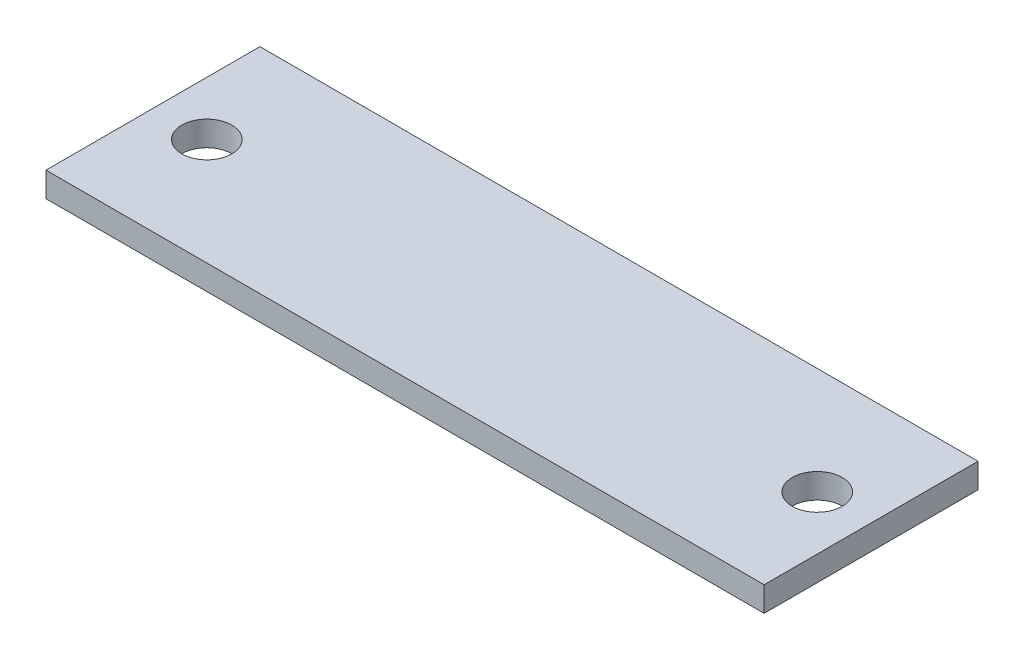
ISO-10303-21;
HEADER;
FILE_DESCRIPTION(('STEP AP214'),'2;1');
FILE_NAME('part.step','',(''),(''),'','','');
FILE_SCHEMA(('AUTOMOTIVE_DESIGN { 1 0 10303 214 1 1 1 1 }'));
ENDSEC;
DATA;
#1=APPLICATION_CONTEXT('core data for automotive mechanical design processes');
#2=APPLICATION_PROTOCOL_DEFINITION('international standard','automotive_design',2000,#1);
#3=PRODUCT_CONTEXT('',#1,'mechanical');
#4=PRODUCT('Part','Part','',(#3));
#5=PRODUCT_RELATED_PRODUCT_CATEGORY('part','',(#4));
#6=PRODUCT_DEFINITION_FORMATION('','',#4);
#7=PRODUCT_DEFINITION_CONTEXT('part definition',#1,'design');
#8=PRODUCT_DEFINITION('design','',#6,#7);
#9=PRODUCT_DEFINITION_SHAPE('','',#8);
#10=(LENGTH_UNIT() NAMED_UNIT(*) SI_UNIT(.MILLI.,.METRE.));
#11=(NAMED_UNIT(*) PLANE_ANGLE_UNIT() SI_UNIT($,.RADIAN.));
#12=(NAMED_UNIT(*) SI_UNIT($,.STERADIAN.) SOLID_ANGLE_UNIT());
#13=UNCERTAINTY_MEASURE_WITH_UNIT(LENGTH_MEASURE(1.E-05),#10,'distance_accuracy_value','');
#14=(GEOMETRIC_REPRESENTATION_CONTEXT(3) GLOBAL_UNCERTAINTY_ASSIGNED_CONTEXT((#13)) GLOBAL_UNIT_ASSIGNED_CONTEXT((#10,
#11,#12)) REPRESENTATION_CONTEXT('',''));
#15=CARTESIAN_POINT('',(0.,0.,0.));
#16=DIRECTION('',(0.,0.,1.));
#17=DIRECTION('',(1.,0.,0.));
#18=AXIS2_PLACEMENT_3D('',#15,#16,#17);
#19=CARTESIAN_POINT('',(0.,0.79375,0.));
#20=DIRECTION('',(0.,-1.,0.));
#21=DIRECTION('',(0.,0.,-1.));
#22=AXIS2_PLACEMENT_3D('',#19,#20,#21);
#23=PLANE('',#22);
#24=DIRECTION('',(0.,0.,-1.));
#25=VECTOR('',#24,1.);
#26=CARTESIAN_POINT('',(22.999999974,0.79375,6.850000016));
#27=LINE('',#26,#25);
#28=CARTESIAN_POINT('',(22.999999974,0.79375,6.850000016));
#29=VERTEX_POINT('',#28);
#30=CARTESIAN_POINT('',(22.999999974,0.79375,-6.850000016));
#31=VERTEX_POINT('',#30);
#32=EDGE_CURVE('E91',#29,#31,#27,.T.);
#33=ORIENTED_EDGE('',*,*,#32,.T.);
#34=DIRECTION('',(-1.,0.,0.));
#35=VECTOR('',#34,1.);
#36=CARTESIAN_POINT('',(-22.999999974,0.79375,-6.850000016));
#37=LINE('',#36,#35);
#38=CARTESIAN_POINT('',(-22.999999974,0.79375,-6.850000016));
#39=VERTEX_POINT('',#38);
#40=EDGE_CURVE('E86',#31,#39,#37,.T.);
#41=ORIENTED_EDGE('',*,*,#40,.T.);
#42=DIRECTION('',(0.,0.,1.));
#43=VECTOR('',#42,1.);
#44=CARTESIAN_POINT('',(-22.999999974,0.79375,6.850000016));
#45=LINE('',#44,#43);
#46=CARTESIAN_POINT('',(-22.999999974,0.79375,6.850000016));
#47=VERTEX_POINT('',#46);
#48=EDGE_CURVE('E89',#39,#47,#45,.T.);
#49=ORIENTED_EDGE('',*,*,#48,.T.);
#50=DIRECTION('',(1.,0.,0.));
#51=VECTOR('',#50,1.);
#52=CARTESIAN_POINT('',(-22.999999974,0.79375,6.850000016));
#53=LINE('',#52,#51);
#54=EDGE_CURVE('E56',#47,#29,#53,.T.);
#55=ORIENTED_EDGE('',*,*,#54,.T.);
#56=EDGE_LOOP('',(#33,#41,#49,#55));
#57=FACE_BOUND('',#56,.T.);
#58=CARTESIAN_POINT('',(-19.550000016,0.79375,0.));
#59=DIRECTION('',(0.,1.,0.));
#60=DIRECTION('',(0.,0.,1.));
#61=AXIS2_PLACEMENT_3D('',#58,#59,#60);
#62=CIRCLE('',#61,1.599999975);
#63=CARTESIAN_POINT('',(-19.550000016,0.79375,1.599999975));
#64=VERTEX_POINT('',#63);
#65=EDGE_CURVE('E106',#64,#64,#62,.T.);
#66=ORIENTED_EDGE('',*,*,#65,.F.);
#67=EDGE_LOOP('',(#66));
#68=FACE_BOUND('',#67,.T.);
#69=CARTESIAN_POINT('',(19.550000016,0.79375,0.));
#70=DIRECTION('',(0.,1.,0.));
#71=DIRECTION('',(0.,0.,1.));
#72=AXIS2_PLACEMENT_3D('',#69,#70,#71);
#73=CIRCLE('',#72,1.599999975);
#74=CARTESIAN_POINT('',(19.550000016,0.79375,1.599999975));
#75=VERTEX_POINT('',#74);
#76=EDGE_CURVE('E121',#75,#75,#73,.T.);
#77=ORIENTED_EDGE('',*,*,#76,.F.);
#78=EDGE_LOOP('',(#77));
#79=FACE_BOUND('',#78,.T.);
#80=ADVANCED_FACE('F39',(#57,#68,#79),#23,.F.);
#81=CARTESIAN_POINT('',(0.,-0.79375,0.));
#82=DIRECTION('',(0.,-1.,0.));
#83=DIRECTION('',(0.,0.,-1.));
#84=AXIS2_PLACEMENT_3D('',#81,#82,#83);
#85=PLANE('',#84);
#86=CARTESIAN_POINT('',(-19.550000016,-0.79375,0.));
#87=DIRECTION('',(0.,1.,0.));
#88=DIRECTION('',(0.,0.,1.));
#89=AXIS2_PLACEMENT_3D('',#86,#87,#88);
#90=CIRCLE('',#89,1.599999975);
#91=CARTESIAN_POINT('',(-19.550000016,-0.79375,1.599999975));
#92=VERTEX_POINT('',#91);
#93=EDGE_CURVE('E118',#92,#92,#90,.T.);
#94=ORIENTED_EDGE('',*,*,#93,.T.);
#95=EDGE_LOOP('',(#94));
#96=FACE_BOUND('',#95,.T.);
#97=DIRECTION('',(0.,0.,-1.));
#98=VECTOR('',#97,1.);
#99=CARTESIAN_POINT('',(22.999999974,-0.79375,6.850000016));
#100=LINE('',#99,#98);
#101=CARTESIAN_POINT('',(22.999999974,-0.79375,6.850000016));
#102=VERTEX_POINT('',#101);
#103=CARTESIAN_POINT('',(22.999999974,-0.79375,-6.850000016));
#104=VERTEX_POINT('',#103);
#105=EDGE_CURVE('E103',#102,#104,#100,.T.);
#106=ORIENTED_EDGE('',*,*,#105,.F.);
#107=DIRECTION('',(1.,0.,0.));
#108=VECTOR('',#107,1.);
#109=CARTESIAN_POINT('',(-22.999999974,-0.79375,6.850000016));
#110=LINE('',#109,#108);
#111=CARTESIAN_POINT('',(-22.999999974,-0.79375,6.850000016));
#112=VERTEX_POINT('',#111);
#113=EDGE_CURVE('E79',#112,#102,#110,.T.);
#114=ORIENTED_EDGE('',*,*,#113,.F.);
#115=DIRECTION('',(0.,0.,1.));
#116=VECTOR('',#115,1.);
#117=CARTESIAN_POINT('',(-22.999999974,-0.79375,6.850000016));
#118=LINE('',#117,#116);
#119=CARTESIAN_POINT('',(-22.999999974,-0.79375,-6.850000016));
#120=VERTEX_POINT('',#119);
#121=EDGE_CURVE('E73',#120,#112,#118,.T.);
#122=ORIENTED_EDGE('',*,*,#121,.F.);
#123=DIRECTION('',(-1.,0.,0.));
#124=VECTOR('',#123,1.);
#125=CARTESIAN_POINT('',(-22.999999974,-0.79375,-6.850000016));
#126=LINE('',#125,#124);
#127=EDGE_CURVE('E95',#104,#120,#126,.T.);
#128=ORIENTED_EDGE('',*,*,#127,.F.);
#129=EDGE_LOOP('',(#106,#114,#122,#128));
#130=FACE_BOUND('',#129,.T.);
#131=CARTESIAN_POINT('',(19.550000016,-0.79375,0.));
#132=DIRECTION('',(0.,1.,0.));
#133=DIRECTION('',(0.,0.,1.));
#134=AXIS2_PLACEMENT_3D('',#131,#132,#133);
#135=CIRCLE('',#134,1.599999975);
#136=CARTESIAN_POINT('',(19.550000016,-0.79375,1.599999975));
#137=VERTEX_POINT('',#136);
#138=EDGE_CURVE('E124',#137,#137,#135,.T.);
#139=ORIENTED_EDGE('',*,*,#138,.T.);
#140=EDGE_LOOP('',(#139));
#141=FACE_BOUND('',#140,.T.);
#142=ADVANCED_FACE('F114',(#96,#130,#141),#85,.T.);
#143=CARTESIAN_POINT('',(22.999999974,0.79375,6.850000016));
#144=DIRECTION('',(-1.,0.,0.));
#145=DIRECTION('',(0.,0.,1.));
#146=AXIS2_PLACEMENT_3D('',#143,#144,#145);
#147=PLANE('',#146);
#148=ORIENTED_EDGE('',*,*,#105,.T.);
#149=DIRECTION('',(0.,-1.,0.));
#150=VECTOR('',#149,1.);
#151=CARTESIAN_POINT('',(22.999999974,0.79375,-6.850000016));
#152=LINE('',#151,#150);
#153=EDGE_CURVE('E11',#31,#104,#152,.T.);
#154=ORIENTED_EDGE('',*,*,#153,.F.);
#155=ORIENTED_EDGE('',*,*,#32,.F.);
#156=DIRECTION('',(0.,-1.,0.));
#157=VECTOR('',#156,1.);
#158=CARTESIAN_POINT('',(22.999999974,0.79375,6.850000016));
#159=LINE('',#158,#157);
#160=EDGE_CURVE('E99',#29,#102,#159,.T.);
#161=ORIENTED_EDGE('',*,*,#160,.T.);
#162=EDGE_LOOP('',(#148,#154,#155,#161));
#163=FACE_BOUND('',#162,.T.);
#164=ADVANCED_FACE('F41',(#163),#147,.F.);
#165=CARTESIAN_POINT('',(-22.999999974,0.79375,-6.850000016));
#166=DIRECTION('',(0.,0.,1.));
#167=DIRECTION('',(1.,0.,0.));
#168=AXIS2_PLACEMENT_3D('',#165,#166,#167);
#169=PLANE('',#168);
#170=ORIENTED_EDGE('',*,*,#127,.T.);
#171=DIRECTION('',(0.,-1.,0.));
#172=VECTOR('',#171,1.);
#173=CARTESIAN_POINT('',(-22.999999974,0.79375,-6.850000016));
#174=LINE('',#173,#172);
#175=EDGE_CURVE('E48',#39,#120,#174,.T.);
#176=ORIENTED_EDGE('',*,*,#175,.F.);
#177=ORIENTED_EDGE('',*,*,#40,.F.);
#178=ORIENTED_EDGE('',*,*,#153,.T.);
#179=EDGE_LOOP('',(#170,#176,#177,#178));
#180=FACE_BOUND('',#179,.T.);
#181=ADVANCED_FACE('F94',(#180),#169,.F.);
#182=CARTESIAN_POINT('',(-22.999999974,0.79375,6.850000016));
#183=DIRECTION('',(1.,0.,0.));
#184=DIRECTION('',(0.,0.,-1.));
#185=AXIS2_PLACEMENT_3D('',#182,#183,#184);
#186=PLANE('',#185);
#187=ORIENTED_EDGE('',*,*,#121,.T.);
#188=DIRECTION('',(0.,-1.,0.));
#189=VECTOR('',#188,1.);
#190=CARTESIAN_POINT('',(-22.999999974,0.79375,6.850000016));
#191=LINE('',#190,#189);
#192=EDGE_CURVE('E96',#47,#112,#191,.T.);
#193=ORIENTED_EDGE('',*,*,#192,.F.);
#194=ORIENTED_EDGE('',*,*,#48,.F.);
#195=ORIENTED_EDGE('',*,*,#175,.T.);
#196=EDGE_LOOP('',(#187,#193,#194,#195));
#197=FACE_BOUND('',#196,.T.);
#198=ADVANCED_FACE('F97',(#197),#186,.F.);
#199=CARTESIAN_POINT('',(-22.999999974,0.79375,6.850000016));
#200=DIRECTION('',(0.,0.,-1.));
#201=DIRECTION('',(-1.,0.,0.));
#202=AXIS2_PLACEMENT_3D('',#199,#200,#201);
#203=PLANE('',#202);
#204=ORIENTED_EDGE('',*,*,#113,.T.);
#205=ORIENTED_EDGE('',*,*,#160,.F.);
#206=ORIENTED_EDGE('',*,*,#54,.F.);
#207=ORIENTED_EDGE('',*,*,#192,.T.);
#208=EDGE_LOOP('',(#204,#205,#206,#207));
#209=FACE_BOUND('',#208,.T.);
#210=ADVANCED_FACE('F111',(#209),#203,.F.);
#211=CARTESIAN_POINT('',(-19.550000016,0.79375,0.));
#212=DIRECTION('',(0.,-1.,0.));
#213=DIRECTION('',(0.,0.,-1.));
#214=AXIS2_PLACEMENT_3D('',#211,#212,#213);
#215=CYLINDRICAL_SURFACE('',#214,1.599999975);
#216=ORIENTED_EDGE('',*,*,#65,.T.);
#217=EDGE_LOOP('',(#216));
#218=FACE_BOUND('',#217,.T.);
#219=ORIENTED_EDGE('',*,*,#93,.F.);
#220=EDGE_LOOP('',(#219));
#221=FACE_BOUND('',#220,.T.);
#222=ADVANCED_FACE('F141',(#218,#221),#215,.F.);
#223=CARTESIAN_POINT('',(19.550000016,0.79375,0.));
#224=DIRECTION('',(0.,-1.,0.));
#225=DIRECTION('',(0.,0.,-1.));
#226=AXIS2_PLACEMENT_3D('',#223,#224,#225);
#227=CYLINDRICAL_SURFACE('',#226,1.599999975);
#228=ORIENTED_EDGE('',*,*,#76,.T.);
#229=EDGE_LOOP('',(#228));
#230=FACE_BOUND('',#229,.T.);
#231=ORIENTED_EDGE('',*,*,#138,.F.);
#232=EDGE_LOOP('',(#231));
#233=FACE_BOUND('',#232,.T.);
#234=ADVANCED_FACE('F130',(#230,#233),#227,.F.);
#235=CLOSED_SHELL('',(#80,#142,#164,#181,#198,#210,#222,#234));
#236=MANIFOLD_SOLID_BREP('B2',#235);
#237=ADVANCED_BREP_SHAPE_REPRESENTATION('',(#18,#236),#14);
#238=SHAPE_DEFINITION_REPRESENTATION(#9,#237);
ENDSEC;
END-ISO-10303-21;
